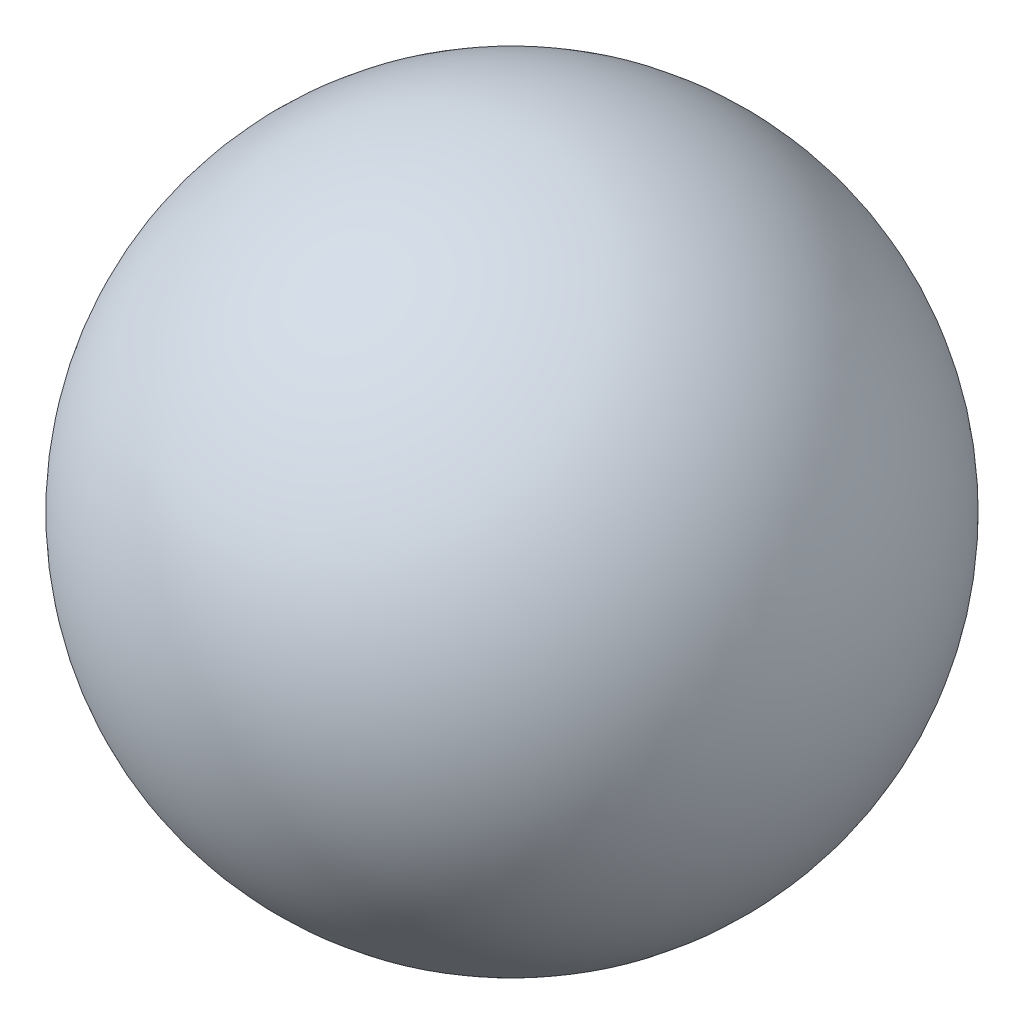
ISO-10303-21;
HEADER;
FILE_DESCRIPTION(('STEP AP214'),'2;1');
FILE_NAME('part.step','',(''),(''),'','','');
FILE_SCHEMA(('AUTOMOTIVE_DESIGN { 1 0 10303 214 1 1 1 1 }'));
ENDSEC;
DATA;
#1=APPLICATION_CONTEXT('core data for automotive mechanical design processes');
#2=APPLICATION_PROTOCOL_DEFINITION('international standard','automotive_design',2000,#1);
#3=PRODUCT_CONTEXT('',#1,'mechanical');
#4=PRODUCT('Part','Part','',(#3));
#5=PRODUCT_RELATED_PRODUCT_CATEGORY('part','',(#4));
#6=PRODUCT_DEFINITION_FORMATION('','',#4);
#7=PRODUCT_DEFINITION_CONTEXT('part definition',#1,'design');
#8=PRODUCT_DEFINITION('design','',#6,#7);
#9=PRODUCT_DEFINITION_SHAPE('','',#8);
#10=(LENGTH_UNIT() NAMED_UNIT(*) SI_UNIT(.MILLI.,.METRE.));
#11=(NAMED_UNIT(*) PLANE_ANGLE_UNIT() SI_UNIT($,.RADIAN.));
#12=(NAMED_UNIT(*) SI_UNIT($,.STERADIAN.) SOLID_ANGLE_UNIT());
#13=UNCERTAINTY_MEASURE_WITH_UNIT(LENGTH_MEASURE(1.E-05),#10,'distance_accuracy_value','');
#14=(GEOMETRIC_REPRESENTATION_CONTEXT(3) GLOBAL_UNCERTAINTY_ASSIGNED_CONTEXT((#13)) GLOBAL_UNIT_ASSIGNED_CONTEXT((#10,
#11,#12)) REPRESENTATION_CONTEXT('',''));
#15=CARTESIAN_POINT('',(0.,0.,0.));
#16=DIRECTION('',(0.,0.,1.));
#17=DIRECTION('',(1.,0.,0.));
#18=AXIS2_PLACEMENT_3D('',#15,#16,#17);
#19=CARTESIAN_POINT('',(0.,0.,0.));
#20=DIRECTION('',(0.,-1.,0.));
#21=DIRECTION('',(-1.,0.,0.));
#22=AXIS2_PLACEMENT_3D('',#19,#20,#21);
#23=SPHERICAL_SURFACE('',#22,3.96875);
#24=CARTESIAN_POINT('',(0.,-3.96875,0.));
#25=VERTEX_POINT('',#24);
#26=VERTEX_LOOP('',#25);
#27=FACE_BOUND('',#26,.T.);
#28=ADVANCED_FACE('F32',(#27),#23,.T.);
#29=CLOSED_SHELL('',(#28));
#30=MANIFOLD_SOLID_BREP('B2',#29);
#31=ADVANCED_BREP_SHAPE_REPRESENTATION('',(#18,#30),#14);
#32=SHAPE_DEFINITION_REPRESENTATION(#9,#31);
ENDSEC;
END-ISO-10303-21;
